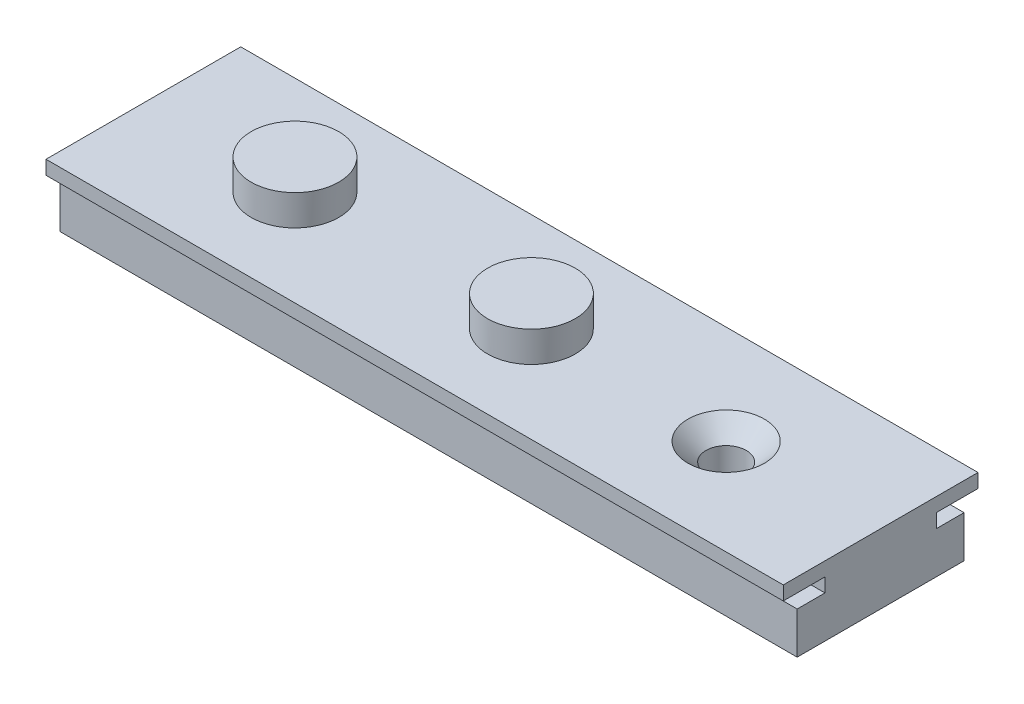
ISO-10303-21;
HEADER;
FILE_DESCRIPTION(('STEP AP214'),'2;1');
FILE_NAME('part.step','',(''),(''),'','','');
FILE_SCHEMA(('AUTOMOTIVE_DESIGN { 1 0 10303 214 1 1 1 1 }'));
ENDSEC;
DATA;
#1=APPLICATION_CONTEXT('core data for automotive mechanical design processes');
#2=APPLICATION_PROTOCOL_DEFINITION('international standard','automotive_design',2000,#1);
#3=PRODUCT_CONTEXT('',#1,'mechanical');
#4=PRODUCT('Part','Part','',(#3));
#5=PRODUCT_RELATED_PRODUCT_CATEGORY('part','',(#4));
#6=PRODUCT_DEFINITION_FORMATION('','',#4);
#7=PRODUCT_DEFINITION_CONTEXT('part definition',#1,'design');
#8=PRODUCT_DEFINITION('design','',#6,#7);
#9=PRODUCT_DEFINITION_SHAPE('','',#8);
#10=(LENGTH_UNIT() NAMED_UNIT(*) SI_UNIT(.MILLI.,.METRE.));
#11=(NAMED_UNIT(*) PLANE_ANGLE_UNIT() SI_UNIT($,.RADIAN.));
#12=(NAMED_UNIT(*) SI_UNIT($,.STERADIAN.) SOLID_ANGLE_UNIT());
#13=UNCERTAINTY_MEASURE_WITH_UNIT(LENGTH_MEASURE(1.E-05),#10,'distance_accuracy_value','');
#14=(GEOMETRIC_REPRESENTATION_CONTEXT(3) GLOBAL_UNCERTAINTY_ASSIGNED_CONTEXT((#13)) GLOBAL_UNIT_ASSIGNED_CONTEXT((#10,
#11,#12)) REPRESENTATION_CONTEXT('',''));
#15=CARTESIAN_POINT('',(0.,0.,0.));
#16=DIRECTION('',(0.,0.,1.));
#17=DIRECTION('',(1.,0.,0.));
#18=AXIS2_PLACEMENT_3D('',#15,#16,#17);
#19=CARTESIAN_POINT('',(53.,0.500000000000019,-3.99999999999998));
#20=DIRECTION('',(0.,0.,1.));
#21=DIRECTION('',(1.,0.,0.));
#22=AXIS2_PLACEMENT_3D('',#19,#20,#21);
#23=PLANE('',#22);
#24=DIRECTION('',(0.,1.,0.));
#25=VECTOR('',#24,1.);
#26=CARTESIAN_POINT('',(0.,0.500000000000019,-3.99999999999998));
#27=LINE('',#26,#25);
#28=CARTESIAN_POINT('',(0.,0.500000000000019,-3.99999999999998));
#29=VERTEX_POINT('',#28);
#30=CARTESIAN_POINT('',(0.,1.50000000000002,-3.99999999999998));
#31=VERTEX_POINT('',#30);
#32=EDGE_CURVE('E167',#29,#31,#27,.T.);
#33=ORIENTED_EDGE('',*,*,#32,.T.);
#34=DIRECTION('',(-1.,0.,0.));
#35=VECTOR('',#34,1.);
#36=CARTESIAN_POINT('',(53.,1.50000000000002,-3.99999999999998));
#37=LINE('',#36,#35);
#38=CARTESIAN_POINT('',(53.,1.50000000000002,-3.99999999999998));
#39=VERTEX_POINT('',#38);
#40=EDGE_CURVE('E237',#39,#31,#37,.T.);
#41=ORIENTED_EDGE('',*,*,#40,.F.);
#42=DIRECTION('',(0.,1.,0.));
#43=VECTOR('',#42,1.);
#44=CARTESIAN_POINT('',(53.,0.500000000000019,-3.99999999999998));
#45=LINE('',#44,#43);
#46=CARTESIAN_POINT('',(53.,0.500000000000019,-3.99999999999998));
#47=VERTEX_POINT('',#46);
#48=EDGE_CURVE('E202',#47,#39,#45,.T.);
#49=ORIENTED_EDGE('',*,*,#48,.F.);
#50=DIRECTION('',(-1.,0.,0.));
#51=VECTOR('',#50,1.);
#52=CARTESIAN_POINT('',(53.,0.500000000000019,-3.99999999999998));
#53=LINE('',#52,#51);
#54=EDGE_CURVE('E163',#47,#29,#53,.T.);
#55=ORIENTED_EDGE('',*,*,#54,.T.);
#56=EDGE_LOOP('',(#33,#41,#49,#55));
#57=FACE_BOUND('',#56,.T.);
#58=ADVANCED_FACE('F41',(#57),#23,.F.);
#59=CARTESIAN_POINT('',(53.,1.50000000000002,-3.99999999999998));
#60=DIRECTION('',(0.,1.,0.));
#61=DIRECTION('',(0.,0.,1.));
#62=AXIS2_PLACEMENT_3D('',#59,#60,#61);
#63=PLANE('',#62);
#64=DIRECTION('',(0.,0.,-1.));
#65=VECTOR('',#64,1.);
#66=CARTESIAN_POINT('',(0.,1.50000000000002,-3.99999999999998));
#67=LINE('',#66,#65);
#68=CARTESIAN_POINT('',(0.,1.50000000000002,-7.00000000000029));
#69=VERTEX_POINT('',#68);
#70=EDGE_CURVE('E171',#31,#69,#67,.T.);
#71=ORIENTED_EDGE('',*,*,#70,.T.);
#72=DIRECTION('',(-1.,0.,0.));
#73=VECTOR('',#72,1.);
#74=CARTESIAN_POINT('',(53.,1.50000000000002,-7.00000000000029));
#75=LINE('',#74,#73);
#76=CARTESIAN_POINT('',(53.,1.50000000000002,-7.00000000000029));
#77=VERTEX_POINT('',#76);
#78=EDGE_CURVE('E233',#77,#69,#75,.T.);
#79=ORIENTED_EDGE('',*,*,#78,.F.);
#80=DIRECTION('',(0.,0.,-1.));
#81=VECTOR('',#80,1.);
#82=CARTESIAN_POINT('',(53.,1.50000000000002,-3.99999999999998));
#83=LINE('',#82,#81);
#84=EDGE_CURVE('E114',#39,#77,#83,.T.);
#85=ORIENTED_EDGE('',*,*,#84,.F.);
#86=ORIENTED_EDGE('',*,*,#40,.T.);
#87=EDGE_LOOP('',(#71,#79,#85,#86));
#88=FACE_BOUND('',#87,.T.);
#89=ADVANCED_FACE('F338',(#88),#63,.F.);
#90=CARTESIAN_POINT('',(53.,1.50000000000002,-7.00000000000029));
#91=DIRECTION('',(0.,0.,1.));
#92=DIRECTION('',(1.,0.,0.));
#93=AXIS2_PLACEMENT_3D('',#90,#91,#92);
#94=PLANE('',#93);
#95=DIRECTION('',(0.,1.,0.));
#96=VECTOR('',#95,1.);
#97=CARTESIAN_POINT('',(0.,1.50000000000002,-7.00000000000029));
#98=LINE('',#97,#96);
#99=CARTESIAN_POINT('',(0.,2.49999999999997,-7.00000000000029));
#100=VERTEX_POINT('',#99);
#101=EDGE_CURVE('E175',#69,#100,#98,.T.);
#102=ORIENTED_EDGE('',*,*,#101,.T.);
#103=DIRECTION('',(-1.,0.,0.));
#104=VECTOR('',#103,1.);
#105=CARTESIAN_POINT('',(53.,2.49999999999997,-7.00000000000029));
#106=LINE('',#105,#104);
#107=CARTESIAN_POINT('',(53.,2.49999999999997,-7.00000000000029));
#108=VERTEX_POINT('',#107);
#109=EDGE_CURVE('E229',#108,#100,#106,.T.);
#110=ORIENTED_EDGE('',*,*,#109,.F.);
#111=DIRECTION('',(0.,1.,0.));
#112=VECTOR('',#111,1.);
#113=CARTESIAN_POINT('',(53.,1.50000000000002,-7.00000000000029));
#114=LINE('',#113,#112);
#115=EDGE_CURVE('E301',#77,#108,#114,.T.);
#116=ORIENTED_EDGE('',*,*,#115,.F.);
#117=ORIENTED_EDGE('',*,*,#78,.T.);
#118=EDGE_LOOP('',(#102,#110,#116,#117));
#119=FACE_BOUND('',#118,.T.);
#120=ADVANCED_FACE('F253',(#119),#94,.F.);
#121=CARTESIAN_POINT('',(53.,2.49999999999997,-7.00000000000029));
#122=DIRECTION('',(0.,-1.,0.));
#123=DIRECTION('',(0.,0.,-1.));
#124=AXIS2_PLACEMENT_3D('',#121,#122,#123);
#125=PLANE('',#124);
#126=CARTESIAN_POINT('',(28.,2.49999999999997,0.103984670209432));
#127=DIRECTION('',(0.,-1.,0.));
#128=DIRECTION('',(0.,0.,-1.));
#129=AXIS2_PLACEMENT_3D('',#126,#127,#128);
#130=CIRCLE('',#129,3.15);
#131=CARTESIAN_POINT('',(28.,2.49999999999997,-3.04601532979057));
#132=VERTEX_POINT('',#131);
#133=EDGE_CURVE('E11',#132,#132,#130,.F.);
#134=ORIENTED_EDGE('',*,*,#133,.F.);
#135=EDGE_LOOP('',(#134));
#136=FACE_BOUND('',#135,.T.);
#137=CARTESIAN_POINT('',(11.,2.49999999999997,0.103984670209494));
#138=DIRECTION('',(0.,-1.,0.));
#139=DIRECTION('',(0.,0.,-1.));
#140=AXIS2_PLACEMENT_3D('',#137,#138,#139);
#141=CIRCLE('',#140,3.15);
#142=CARTESIAN_POINT('',(11.,2.49999999999997,-3.04601532979051));
#143=VERTEX_POINT('',#142);
#144=EDGE_CURVE('E50',#143,#143,#141,.F.);
#145=ORIENTED_EDGE('',*,*,#144,.F.);
#146=EDGE_LOOP('',(#145));
#147=FACE_BOUND('',#146,.T.);
#148=CARTESIAN_POINT('',(42.,2.49999999999997,0.103984670209383));
#149=DIRECTION('',(0.,1.,0.));
#150=DIRECTION('',(0.,0.,1.));
#151=AXIS2_PLACEMENT_3D('',#148,#149,#150);
#152=CIRCLE('',#151,2.75);
#153=CARTESIAN_POINT('',(42.,2.49999999999996,2.85398467020939));
#154=VERTEX_POINT('',#153);
#155=EDGE_CURVE('E259',#154,#154,#152,.T.);
#156=ORIENTED_EDGE('',*,*,#155,.F.);
#157=EDGE_LOOP('',(#156));
#158=FACE_BOUND('',#157,.T.);
#159=DIRECTION('',(0.,0.,1.));
#160=VECTOR('',#159,1.);
#161=CARTESIAN_POINT('',(0.,2.49999999999997,-7.00000000000029));
#162=LINE('',#161,#160);
#163=CARTESIAN_POINT('',(0.,2.49999999999996,7.00000000000001));
#164=VERTEX_POINT('',#163);
#165=EDGE_CURVE('E178',#100,#164,#162,.T.);
#166=ORIENTED_EDGE('',*,*,#165,.T.);
#167=DIRECTION('',(-1.,0.,0.));
#168=VECTOR('',#167,1.);
#169=CARTESIAN_POINT('',(53.,2.49999999999996,7.00000000000001));
#170=LINE('',#169,#168);
#171=CARTESIAN_POINT('',(53.,2.49999999999996,7.00000000000001));
#172=VERTEX_POINT('',#171);
#173=EDGE_CURVE('E225',#172,#164,#170,.T.);
#174=ORIENTED_EDGE('',*,*,#173,.F.);
#175=DIRECTION('',(0.,0.,1.));
#176=VECTOR('',#175,1.);
#177=CARTESIAN_POINT('',(53.,2.49999999999997,-7.00000000000029));
#178=LINE('',#177,#176);
#179=EDGE_CURVE('E298',#108,#172,#178,.T.);
#180=ORIENTED_EDGE('',*,*,#179,.F.);
#181=ORIENTED_EDGE('',*,*,#109,.T.);
#182=EDGE_LOOP('',(#166,#174,#180,#181));
#183=FACE_BOUND('',#182,.T.);
#184=ADVANCED_FACE('F249',(#136,#147,#158,#183),#125,.F.);
#185=CARTESIAN_POINT('',(53.,1.49999999999996,7.00000000000001));
#186=DIRECTION('',(0.,0.,-1.));
#187=DIRECTION('',(0.,1.,0.));
#188=AXIS2_PLACEMENT_3D('',#185,#186,#187);
#189=PLANE('',#188);
#190=DIRECTION('',(0.,-1.,0.));
#191=VECTOR('',#190,1.);
#192=CARTESIAN_POINT('',(0.,1.49999999999996,7.00000000000001));
#193=LINE('',#192,#191);
#194=CARTESIAN_POINT('',(0.,1.49999999999996,7.00000000000001));
#195=VERTEX_POINT('',#194);
#196=EDGE_CURVE('E181',#164,#195,#193,.T.);
#197=ORIENTED_EDGE('',*,*,#196,.T.);
#198=DIRECTION('',(-1.,0.,0.));
#199=VECTOR('',#198,1.);
#200=CARTESIAN_POINT('',(53.,1.49999999999996,7.00000000000001));
#201=LINE('',#200,#199);
#202=CARTESIAN_POINT('',(53.,1.49999999999996,7.00000000000001));
#203=VERTEX_POINT('',#202);
#204=EDGE_CURVE('E221',#203,#195,#201,.T.);
#205=ORIENTED_EDGE('',*,*,#204,.F.);
#206=DIRECTION('',(0.,-1.,0.));
#207=VECTOR('',#206,1.);
#208=CARTESIAN_POINT('',(53.,1.49999999999996,7.00000000000001));
#209=LINE('',#208,#207);
#210=EDGE_CURVE('E270',#172,#203,#209,.T.);
#211=ORIENTED_EDGE('',*,*,#210,.F.);
#212=ORIENTED_EDGE('',*,*,#173,.T.);
#213=EDGE_LOOP('',(#197,#205,#211,#212));
#214=FACE_BOUND('',#213,.T.);
#215=ADVANCED_FACE('F252',(#214),#189,.F.);
#216=CARTESIAN_POINT('',(53.,1.49999999999996,4.00000000000014));
#217=DIRECTION('',(0.,1.,0.));
#218=DIRECTION('',(0.,0.,1.));
#219=AXIS2_PLACEMENT_3D('',#216,#217,#218);
#220=PLANE('',#219);
#221=DIRECTION('',(0.,0.,-1.));
#222=VECTOR('',#221,1.);
#223=CARTESIAN_POINT('',(0.,1.49999999999996,4.00000000000014));
#224=LINE('',#223,#222);
#225=CARTESIAN_POINT('',(0.,1.49999999999996,4.00000000000014));
#226=VERTEX_POINT('',#225);
#227=EDGE_CURVE('E184',#195,#226,#224,.T.);
#228=ORIENTED_EDGE('',*,*,#227,.T.);
#229=DIRECTION('',(-1.,0.,0.));
#230=VECTOR('',#229,1.);
#231=CARTESIAN_POINT('',(53.,1.49999999999996,4.00000000000014));
#232=LINE('',#231,#230);
#233=CARTESIAN_POINT('',(53.,1.49999999999996,4.00000000000014));
#234=VERTEX_POINT('',#233);
#235=EDGE_CURVE('E217',#234,#226,#232,.T.);
#236=ORIENTED_EDGE('',*,*,#235,.F.);
#237=DIRECTION('',(0.,0.,-1.));
#238=VECTOR('',#237,1.);
#239=CARTESIAN_POINT('',(53.,1.49999999999996,4.00000000000014));
#240=LINE('',#239,#238);
#241=EDGE_CURVE('E288',#203,#234,#240,.T.);
#242=ORIENTED_EDGE('',*,*,#241,.F.);
#243=ORIENTED_EDGE('',*,*,#204,.T.);
#244=EDGE_LOOP('',(#228,#236,#242,#243));
#245=FACE_BOUND('',#244,.T.);
#246=ADVANCED_FACE('F278',(#245),#220,.F.);
#247=CARTESIAN_POINT('',(53.,0.500000000000034,4.00000000000014));
#248=DIRECTION('',(0.,0.,-1.));
#249=DIRECTION('',(-1.,0.,0.));
#250=AXIS2_PLACEMENT_3D('',#247,#248,#249);
#251=PLANE('',#250);
#252=DIRECTION('',(0.,-1.,0.));
#253=VECTOR('',#252,1.);
#254=CARTESIAN_POINT('',(0.,0.500000000000034,4.00000000000014));
#255=LINE('',#254,#253);
#256=CARTESIAN_POINT('',(0.,0.500000000000034,4.00000000000014));
#257=VERTEX_POINT('',#256);
#258=EDGE_CURVE('E187',#226,#257,#255,.T.);
#259=ORIENTED_EDGE('',*,*,#258,.T.);
#260=DIRECTION('',(-1.,0.,0.));
#261=VECTOR('',#260,1.);
#262=CARTESIAN_POINT('',(53.,0.500000000000034,4.00000000000014));
#263=LINE('',#262,#261);
#264=CARTESIAN_POINT('',(53.,0.500000000000034,4.00000000000014));
#265=VERTEX_POINT('',#264);
#266=EDGE_CURVE('E213',#265,#257,#263,.T.);
#267=ORIENTED_EDGE('',*,*,#266,.F.);
#268=DIRECTION('',(0.,-1.,0.));
#269=VECTOR('',#268,1.);
#270=CARTESIAN_POINT('',(53.,0.500000000000034,4.00000000000014));
#271=LINE('',#270,#269);
#272=EDGE_CURVE('E284',#234,#265,#271,.T.);
#273=ORIENTED_EDGE('',*,*,#272,.F.);
#274=ORIENTED_EDGE('',*,*,#235,.T.);
#275=EDGE_LOOP('',(#259,#267,#273,#274));
#276=FACE_BOUND('',#275,.T.);
#277=ADVANCED_FACE('F282',(#276),#251,.F.);
#278=CARTESIAN_POINT('',(53.,0.500000000000034,6.00000000000014));
#279=DIRECTION('',(0.,-1.,0.));
#280=DIRECTION('',(0.,0.,-1.));
#281=AXIS2_PLACEMENT_3D('',#278,#279,#280);
#282=PLANE('',#281);
#283=DIRECTION('',(0.,0.,1.));
#284=VECTOR('',#283,1.);
#285=CARTESIAN_POINT('',(0.,0.500000000000034,6.00000000000014));
#286=LINE('',#285,#284);
#287=CARTESIAN_POINT('',(0.,0.500000000000034,6.00000000000014));
#288=VERTEX_POINT('',#287);
#289=EDGE_CURVE('E190',#257,#288,#286,.T.);
#290=ORIENTED_EDGE('',*,*,#289,.T.);
#291=DIRECTION('',(-1.,0.,0.));
#292=VECTOR('',#291,1.);
#293=CARTESIAN_POINT('',(53.,0.500000000000034,6.00000000000014));
#294=LINE('',#293,#292);
#295=CARTESIAN_POINT('',(53.,0.500000000000034,6.00000000000014));
#296=VERTEX_POINT('',#295);
#297=EDGE_CURVE('E209',#296,#288,#294,.T.);
#298=ORIENTED_EDGE('',*,*,#297,.F.);
#299=DIRECTION('',(0.,0.,1.));
#300=VECTOR('',#299,1.);
#301=CARTESIAN_POINT('',(53.,0.500000000000034,6.00000000000014));
#302=LINE('',#301,#300);
#303=EDGE_CURVE('E287',#265,#296,#302,.T.);
#304=ORIENTED_EDGE('',*,*,#303,.F.);
#305=ORIENTED_EDGE('',*,*,#266,.T.);
#306=EDGE_LOOP('',(#290,#298,#304,#305));
#307=FACE_BOUND('',#306,.T.);
#308=ADVANCED_FACE('F358',(#307),#282,.F.);
#309=CARTESIAN_POINT('',(53.,-2.5,6.00000000000014));
#310=DIRECTION('',(0.,0.,-1.));
#311=DIRECTION('',(-1.,0.,0.));
#312=AXIS2_PLACEMENT_3D('',#309,#310,#311);
#313=PLANE('',#312);
#314=DIRECTION('',(0.,-1.,0.));
#315=VECTOR('',#314,1.);
#316=CARTESIAN_POINT('',(0.,-2.5,6.00000000000014));
#317=LINE('',#316,#315);
#318=CARTESIAN_POINT('',(0.,-2.5,6.00000000000014));
#319=VERTEX_POINT('',#318);
#320=EDGE_CURVE('E193',#288,#319,#317,.T.);
#321=ORIENTED_EDGE('',*,*,#320,.T.);
#322=DIRECTION('',(-1.,0.,0.));
#323=VECTOR('',#322,1.);
#324=CARTESIAN_POINT('',(53.,-2.5,6.00000000000014));
#325=LINE('',#324,#323);
#326=CARTESIAN_POINT('',(53.,-2.5,6.00000000000014));
#327=VERTEX_POINT('',#326);
#328=EDGE_CURVE('E156',#327,#319,#325,.T.);
#329=ORIENTED_EDGE('',*,*,#328,.F.);
#330=DIRECTION('',(0.,-1.,0.));
#331=VECTOR('',#330,1.);
#332=CARTESIAN_POINT('',(53.,-2.5,6.00000000000014));
#333=LINE('',#332,#331);
#334=EDGE_CURVE('E145',#296,#327,#333,.T.);
#335=ORIENTED_EDGE('',*,*,#334,.F.);
#336=ORIENTED_EDGE('',*,*,#297,.T.);
#337=EDGE_LOOP('',(#321,#329,#335,#336));
#338=FACE_BOUND('',#337,.T.);
#339=ADVANCED_FACE('F361',(#338),#313,.F.);
#340=CARTESIAN_POINT('',(53.,-2.5,-6.00000000000016));
#341=DIRECTION('',(0.,1.,0.));
#342=DIRECTION('',(0.,0.,1.));
#343=AXIS2_PLACEMENT_3D('',#340,#341,#342);
#344=PLANE('',#343);
#345=CARTESIAN_POINT('',(42.,-2.5,0.103984670209383));
#346=DIRECTION('',(0.,1.,0.));
#347=DIRECTION('',(0.,0.,1.));
#348=AXIS2_PLACEMENT_3D('',#345,#346,#347);
#349=CIRCLE('',#348,1.45);
#350=CARTESIAN_POINT('',(42.,-2.5,1.55398467020938));
#351=VERTEX_POINT('',#350);
#352=EDGE_CURVE('E172',#351,#351,#349,.T.);
#353=ORIENTED_EDGE('',*,*,#352,.T.);
#354=EDGE_LOOP('',(#353));
#355=FACE_BOUND('',#354,.T.);
#356=DIRECTION('',(0.,0.,-1.));
#357=VECTOR('',#356,1.);
#358=CARTESIAN_POINT('',(0.,-2.5,-6.00000000000016));
#359=LINE('',#358,#357);
#360=CARTESIAN_POINT('',(0.,-2.5,-6.00000000000016));
#361=VERTEX_POINT('',#360);
#362=EDGE_CURVE('E154',#319,#361,#359,.T.);
#363=ORIENTED_EDGE('',*,*,#362,.T.);
#364=DIRECTION('',(-1.,0.,0.));
#365=VECTOR('',#364,1.);
#366=CARTESIAN_POINT('',(53.,-2.5,-6.00000000000016));
#367=LINE('',#366,#365);
#368=CARTESIAN_POINT('',(53.,-2.5,-6.00000000000016));
#369=VERTEX_POINT('',#368);
#370=EDGE_CURVE('E151',#369,#361,#367,.T.);
#371=ORIENTED_EDGE('',*,*,#370,.F.);
#372=DIRECTION('',(0.,0.,-1.));
#373=VECTOR('',#372,1.);
#374=CARTESIAN_POINT('',(53.,-2.5,-6.00000000000016));
#375=LINE('',#374,#373);
#376=EDGE_CURVE('E139',#327,#369,#375,.T.);
#377=ORIENTED_EDGE('',*,*,#376,.F.);
#378=ORIENTED_EDGE('',*,*,#328,.T.);
#379=EDGE_LOOP('',(#363,#371,#377,#378));
#380=FACE_BOUND('',#379,.T.);
#381=ADVANCED_FACE('F152',(#355,#380),#344,.F.);
#382=CARTESIAN_POINT('',(53.,0.500000000000019,-6.00000000000016));
#383=DIRECTION('',(0.,0.,1.));
#384=DIRECTION('',(0.,-1.,0.));
#385=AXIS2_PLACEMENT_3D('',#382,#383,#384);
#386=PLANE('',#385);
#387=DIRECTION('',(0.,1.,0.));
#388=VECTOR('',#387,1.);
#389=CARTESIAN_POINT('',(0.,0.500000000000019,-6.00000000000016));
#390=LINE('',#389,#388);
#391=CARTESIAN_POINT('',(0.,0.500000000000019,-6.00000000000016));
#392=VERTEX_POINT('',#391);
#393=EDGE_CURVE('E99',#361,#392,#390,.T.);
#394=ORIENTED_EDGE('',*,*,#393,.T.);
#395=DIRECTION('',(-1.,0.,0.));
#396=VECTOR('',#395,1.);
#397=CARTESIAN_POINT('',(53.,0.500000000000019,-6.00000000000016));
#398=LINE('',#397,#396);
#399=CARTESIAN_POINT('',(53.,0.500000000000019,-6.00000000000016));
#400=VERTEX_POINT('',#399);
#401=EDGE_CURVE('E157',#400,#392,#398,.T.);
#402=ORIENTED_EDGE('',*,*,#401,.F.);
#403=DIRECTION('',(0.,1.,0.));
#404=VECTOR('',#403,1.);
#405=CARTESIAN_POINT('',(53.,0.500000000000019,-6.00000000000016));
#406=LINE('',#405,#404);
#407=EDGE_CURVE('E143',#369,#400,#406,.T.);
#408=ORIENTED_EDGE('',*,*,#407,.F.);
#409=ORIENTED_EDGE('',*,*,#370,.T.);
#410=EDGE_LOOP('',(#394,#402,#408,#409));
#411=FACE_BOUND('',#410,.T.);
#412=ADVANCED_FACE('F159',(#411),#386,.F.);
#413=CARTESIAN_POINT('',(53.,0.500000000000019,-3.99999999999998));
#414=DIRECTION('',(0.,-1.,0.));
#415=DIRECTION('',(0.,0.,-1.));
#416=AXIS2_PLACEMENT_3D('',#413,#414,#415);
#417=PLANE('',#416);
#418=DIRECTION('',(0.,0.,1.));
#419=VECTOR('',#418,1.);
#420=CARTESIAN_POINT('',(0.,0.500000000000019,-3.99999999999998));
#421=LINE('',#420,#419);
#422=EDGE_CURVE('E105',#392,#29,#421,.T.);
#423=ORIENTED_EDGE('',*,*,#422,.T.);
#424=ORIENTED_EDGE('',*,*,#54,.F.);
#425=DIRECTION('',(0.,0.,1.));
#426=VECTOR('',#425,1.);
#427=CARTESIAN_POINT('',(53.,0.500000000000019,-3.99999999999998));
#428=LINE('',#427,#426);
#429=EDGE_CURVE('E58',#400,#47,#428,.T.);
#430=ORIENTED_EDGE('',*,*,#429,.F.);
#431=ORIENTED_EDGE('',*,*,#401,.T.);
#432=EDGE_LOOP('',(#423,#424,#430,#431));
#433=FACE_BOUND('',#432,.T.);
#434=ADVANCED_FACE('F371',(#433),#417,.F.);
#435=CARTESIAN_POINT('',(53.,0.,0.));
#436=DIRECTION('',(-1.,0.,0.));
#437=DIRECTION('',(0.,0.,1.));
#438=AXIS2_PLACEMENT_3D('',#435,#436,#437);
#439=PLANE('',#438);
#440=ORIENTED_EDGE('',*,*,#48,.T.);
#441=ORIENTED_EDGE('',*,*,#84,.T.);
#442=ORIENTED_EDGE('',*,*,#115,.T.);
#443=ORIENTED_EDGE('',*,*,#179,.T.);
#444=ORIENTED_EDGE('',*,*,#210,.T.);
#445=ORIENTED_EDGE('',*,*,#241,.T.);
#446=ORIENTED_EDGE('',*,*,#272,.T.);
#447=ORIENTED_EDGE('',*,*,#303,.T.);
#448=ORIENTED_EDGE('',*,*,#334,.T.);
#449=ORIENTED_EDGE('',*,*,#376,.T.);
#450=ORIENTED_EDGE('',*,*,#407,.T.);
#451=ORIENTED_EDGE('',*,*,#429,.T.);
#452=EDGE_LOOP('',(#440,#441,#442,#443,#444,#445,#446,#447,#448,#449,#450,#451));
#453=FACE_BOUND('',#452,.T.);
#454=ADVANCED_FACE('F141',(#453),#439,.F.);
#455=CARTESIAN_POINT('',(0.,0.,0.));
#456=DIRECTION('',(-1.,0.,0.));
#457=DIRECTION('',(0.,0.,1.));
#458=AXIS2_PLACEMENT_3D('',#455,#456,#457);
#459=PLANE('',#458);
#460=ORIENTED_EDGE('',*,*,#32,.F.);
#461=ORIENTED_EDGE('',*,*,#422,.F.);
#462=ORIENTED_EDGE('',*,*,#393,.F.);
#463=ORIENTED_EDGE('',*,*,#362,.F.);
#464=ORIENTED_EDGE('',*,*,#320,.F.);
#465=ORIENTED_EDGE('',*,*,#289,.F.);
#466=ORIENTED_EDGE('',*,*,#258,.F.);
#467=ORIENTED_EDGE('',*,*,#227,.F.);
#468=ORIENTED_EDGE('',*,*,#196,.F.);
#469=ORIENTED_EDGE('',*,*,#165,.F.);
#470=ORIENTED_EDGE('',*,*,#101,.F.);
#471=ORIENTED_EDGE('',*,*,#70,.F.);
#472=EDGE_LOOP('',(#460,#461,#462,#463,#464,#465,#466,#467,#468,#469,#470,#471));
#473=FACE_BOUND('',#472,.T.);
#474=ADVANCED_FACE('F273',(#473),#459,.T.);
#475=CARTESIAN_POINT('',(42.,2.49999999999997,0.103984670209383));
#476=DIRECTION('',(0.,1.,0.));
#477=DIRECTION('',(0.,0.,1.));
#478=AXIS2_PLACEMENT_3D('',#475,#476,#477);
#479=CYLINDRICAL_SURFACE('',#478,1.45);
#480=CARTESIAN_POINT('',(42.,1.19999999999996,0.103984670209383));
#481=DIRECTION('',(0.,1.,0.));
#482=DIRECTION('',(0.,0.,1.));
#483=AXIS2_PLACEMENT_3D('',#480,#481,#482);
#484=CIRCLE('',#483,1.45);
#485=CARTESIAN_POINT('',(42.,1.19999999999996,1.55398467020938));
#486=VERTEX_POINT('',#485);
#487=EDGE_CURVE('E242',#486,#486,#484,.T.);
#488=ORIENTED_EDGE('',*,*,#487,.T.);
#489=EDGE_LOOP('',(#488));
#490=FACE_BOUND('',#489,.T.);
#491=ORIENTED_EDGE('',*,*,#352,.F.);
#492=EDGE_LOOP('',(#491));
#493=FACE_BOUND('',#492,.T.);
#494=ADVANCED_FACE('F376',(#490,#493),#479,.F.);
#495=CARTESIAN_POINT('',(42.,2.49999999999997,0.103984670209383));
#496=DIRECTION('',(0.,1.,0.));
#497=DIRECTION('',(0.,0.,1.));
#498=AXIS2_PLACEMENT_3D('',#495,#496,#497);
#499=CONICAL_SURFACE('',#498,2.75,0.785398163397448);
#500=ORIENTED_EDGE('',*,*,#487,.F.);
#501=EDGE_LOOP('',(#500));
#502=FACE_BOUND('',#501,.T.);
#503=ORIENTED_EDGE('',*,*,#155,.T.);
#504=EDGE_LOOP('',(#503));
#505=FACE_BOUND('',#504,.T.);
#506=ADVANCED_FACE('F381',(#502,#505),#499,.F.);
#507=CARTESIAN_POINT('',(11.,4.69999999999997,0.103984670209495));
#508=DIRECTION('',(0.,-1.,0.));
#509=DIRECTION('',(0.,0.,-1.));
#510=AXIS2_PLACEMENT_3D('',#507,#508,#509);
#511=CYLINDRICAL_SURFACE('',#510,3.15);
#512=CARTESIAN_POINT('',(11.,4.69999999999997,0.103984670209495));
#513=DIRECTION('',(0.,1.,0.));
#514=DIRECTION('',(0.,0.,1.));
#515=AXIS2_PLACEMENT_3D('',#512,#513,#514);
#516=CIRCLE('',#515,3.15);
#517=CARTESIAN_POINT('',(11.,4.69999999999997,3.2539846702095));
#518=VERTEX_POINT('',#517);
#519=EDGE_CURVE('E313',#518,#518,#516,.T.);
#520=ORIENTED_EDGE('',*,*,#519,.F.);
#521=EDGE_LOOP('',(#520));
#522=FACE_BOUND('',#521,.T.);
#523=ORIENTED_EDGE('',*,*,#144,.T.);
#524=EDGE_LOOP('',(#523));
#525=FACE_BOUND('',#524,.T.);
#526=ADVANCED_FACE('F247',(#522,#525),#511,.T.);
#527=CARTESIAN_POINT('',(0.,4.69999999999997,0.));
#528=DIRECTION('',(0.,1.,0.));
#529=DIRECTION('',(0.,0.,1.));
#530=AXIS2_PLACEMENT_3D('',#527,#528,#529);
#531=PLANE('',#530);
#532=ORIENTED_EDGE('',*,*,#519,.T.);
#533=EDGE_LOOP('',(#532));
#534=FACE_BOUND('',#533,.T.);
#535=ADVANCED_FACE('F327',(#534),#531,.T.);
#536=CARTESIAN_POINT('',(28.,4.69999999999997,0.103984670209432));
#537=DIRECTION('',(0.,-1.,0.));
#538=DIRECTION('',(0.,0.,-1.));
#539=AXIS2_PLACEMENT_3D('',#536,#537,#538);
#540=CYLINDRICAL_SURFACE('',#539,3.15);
#541=CARTESIAN_POINT('',(28.,4.69999999999997,0.103984670209432));
#542=DIRECTION('',(0.,1.,0.));
#543=DIRECTION('',(0.,0.,1.));
#544=AXIS2_PLACEMENT_3D('',#541,#542,#543);
#545=CIRCLE('',#544,3.15);
#546=CARTESIAN_POINT('',(28.,4.69999999999997,3.25398467020944));
#547=VERTEX_POINT('',#546);
#548=EDGE_CURVE('E317',#547,#547,#545,.T.);
#549=ORIENTED_EDGE('',*,*,#548,.F.);
#550=EDGE_LOOP('',(#549));
#551=FACE_BOUND('',#550,.T.);
#552=ORIENTED_EDGE('',*,*,#133,.T.);
#553=EDGE_LOOP('',(#552));
#554=FACE_BOUND('',#553,.T.);
#555=ADVANCED_FACE('F324',(#551,#554),#540,.T.);
#556=CARTESIAN_POINT('',(0.,4.69999999999997,0.));
#557=DIRECTION('',(0.,1.,0.));
#558=DIRECTION('',(0.,0.,1.));
#559=AXIS2_PLACEMENT_3D('',#556,#557,#558);
#560=PLANE('',#559);
#561=ORIENTED_EDGE('',*,*,#548,.T.);
#562=EDGE_LOOP('',(#561));
#563=FACE_BOUND('',#562,.T.);
#564=ADVANCED_FACE('F322',(#563),#560,.T.);
#565=CLOSED_SHELL('',(#58,#89,#120,#184,#215,#246,#277,#308,#339,#381,#412,#434,#454,#474,#494,
#506,#526,#535,#555,#564));
#566=MANIFOLD_SOLID_BREP('B2',#565);
#567=ADVANCED_BREP_SHAPE_REPRESENTATION('',(#18,#566),#14);
#568=SHAPE_DEFINITION_REPRESENTATION(#9,#567);
ENDSEC;
END-ISO-10303-21;
